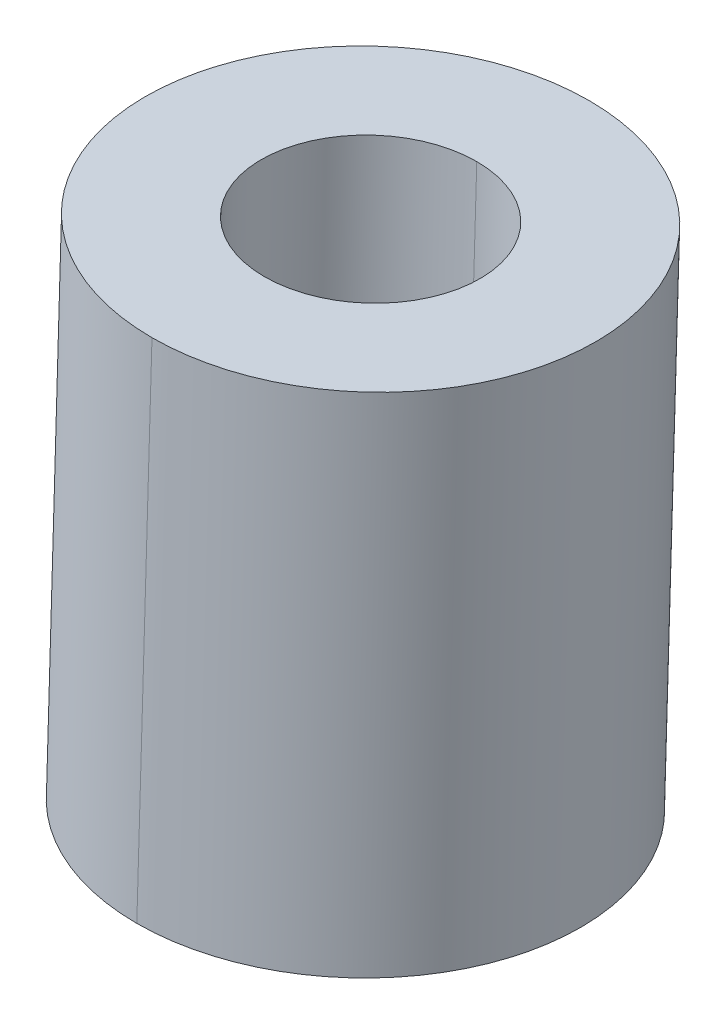
ISO-10303-21;
HEADER;
FILE_DESCRIPTION(('STEP AP214'),'2;1');
FILE_NAME('part.step','',(''),(''),'','','');
FILE_SCHEMA(('AUTOMOTIVE_DESIGN { 1 0 10303 214 1 1 1 1 }'));
ENDSEC;
DATA;
#1=APPLICATION_CONTEXT('core data for automotive mechanical design processes');
#2=APPLICATION_PROTOCOL_DEFINITION('international standard','automotive_design',2000,#1);
#3=PRODUCT_CONTEXT('',#1,'mechanical');
#4=PRODUCT('Part','Part','',(#3));
#5=PRODUCT_RELATED_PRODUCT_CATEGORY('part','',(#4));
#6=PRODUCT_DEFINITION_FORMATION('','',#4);
#7=PRODUCT_DEFINITION_CONTEXT('part definition',#1,'design');
#8=PRODUCT_DEFINITION('design','',#6,#7);
#9=PRODUCT_DEFINITION_SHAPE('','',#8);
#10=(LENGTH_UNIT() NAMED_UNIT(*) SI_UNIT(.MILLI.,.METRE.));
#11=(NAMED_UNIT(*) PLANE_ANGLE_UNIT() SI_UNIT($,.RADIAN.));
#12=(NAMED_UNIT(*) SI_UNIT($,.STERADIAN.) SOLID_ANGLE_UNIT());
#13=UNCERTAINTY_MEASURE_WITH_UNIT(LENGTH_MEASURE(1.E-05),#10,'distance_accuracy_value','');
#14=(GEOMETRIC_REPRESENTATION_CONTEXT(3) GLOBAL_UNCERTAINTY_ASSIGNED_CONTEXT((#13)) GLOBAL_UNIT_ASSIGNED_CONTEXT((#10,
#11,#12)) REPRESENTATION_CONTEXT('',''));
#15=CARTESIAN_POINT('',(0.,0.,0.));
#16=DIRECTION('',(0.,0.,1.));
#17=DIRECTION('',(1.,0.,0.));
#18=AXIS2_PLACEMENT_3D('',#15,#16,#17);
#19=CARTESIAN_POINT('',(30.8591364522028,255.883330990182,223.750519386136));
#20=DIRECTION('',(0.,-0.999538214785378,0.0303867929149983));
#21=DIRECTION('',(0.,-0.0303867929149983,-0.999538214785378));
#22=AXIS2_PLACEMENT_3D('',#19,#20,#21);
#23=CYLINDRICAL_SURFACE('',#22,1.7);
#24=DIRECTION('',(0.,-0.999538214785378,0.0303867929150144));
#25=VECTOR('',#24,1.);
#26=CARTESIAN_POINT('',(30.8591364522028,255.934988538137,225.449734351271));
#27=LINE('',#26,#25);
#28=CARTESIAN_POINT('',(30.8591364522028,255.934988538137,225.449734351271));
#29=VERTEX_POINT('',#28);
#30=CARTESIAN_POINT('',(30.8591364522028,247.938682819854,225.692828694591));
#31=VERTEX_POINT('',#30);
#32=EDGE_CURVE('E89',#29,#31,#27,.T.);
#33=ORIENTED_EDGE('',*,*,#32,.F.);
#34=CARTESIAN_POINT('',(30.8591364522028,255.883330990182,223.750519386136));
#35=DIRECTION('',(0.,0.999538214785378,-0.0303867929149983));
#36=DIRECTION('',(0.,0.0303867929149983,0.999538214785378));
#37=AXIS2_PLACEMENT_3D('',#34,#35,#36);
#38=CIRCLE('',#37,1.7);
#39=CARTESIAN_POINT('',(30.8591364522028,255.831673442226,222.051304421001));
#40=VERTEX_POINT('',#39);
#41=EDGE_CURVE('E19',#29,#40,#38,.T.);
#42=ORIENTED_EDGE('',*,*,#41,.T.);
#43=DIRECTION('',(0.,-0.999538214785378,0.0303867929150144));
#44=VECTOR('',#43,1.);
#45=CARTESIAN_POINT('',(30.8591364522028,255.831673442226,222.051304421001));
#46=LINE('',#45,#44);
#47=CARTESIAN_POINT('',(30.8591364522028,247.835367723943,222.294398764321));
#48=VERTEX_POINT('',#47);
#49=EDGE_CURVE('E81',#40,#48,#46,.T.);
#50=ORIENTED_EDGE('',*,*,#49,.T.);
#51=CARTESIAN_POINT('',(30.8591364522028,247.887025271899,223.993613729456));
#52=DIRECTION('',(0.,0.999538214785378,-0.0303867929150145));
#53=DIRECTION('',(0.,0.0303867929150145,0.999538214785378));
#54=AXIS2_PLACEMENT_3D('',#51,#52,#53);
#55=CIRCLE('',#54,1.7);
#56=EDGE_CURVE('E10',#31,#48,#55,.T.);
#57=ORIENTED_EDGE('',*,*,#56,.F.);
#58=EDGE_LOOP('',(#33,#42,#50,#57));
#59=FACE_BOUND('',#58,.T.);
#60=ADVANCED_FACE('F15',(#59),#23,.F.);
#61=CARTESIAN_POINT('',(30.8591364522028,255.883330990182,223.750519386136));
#62=DIRECTION('',(0.,-0.999538214785378,0.0303867929150206));
#63=DIRECTION('',(0.,-0.0303867929150207,-0.999538214785378));
#64=AXIS2_PLACEMENT_3D('',#61,#62,#63);
#65=CYLINDRICAL_SURFACE('',#64,3.5);
#66=DIRECTION('',(0.,-0.999538214785378,0.0303867929150144));
#67=VECTOR('',#66,1.);
#68=CARTESIAN_POINT('',(30.8591364522028,255.989684765384,227.248903137885));
#69=LINE('',#68,#67);
#70=CARTESIAN_POINT('',(30.8591364522028,255.989684765384,227.248903137885));
#71=VERTEX_POINT('',#70);
#72=CARTESIAN_POINT('',(30.8591364522028,247.993379047102,227.491997481204));
#73=VERTEX_POINT('',#72);
#74=EDGE_CURVE('E108',#71,#73,#69,.T.);
#75=ORIENTED_EDGE('',*,*,#74,.F.);
#76=CARTESIAN_POINT('',(30.8591364522028,255.883330990182,223.750519386136));
#77=DIRECTION('',(0.,0.999538214785378,-0.0303867929150206));
#78=DIRECTION('',(0.,0.0303867929150207,0.999538214785378));
#79=AXIS2_PLACEMENT_3D('',#76,#77,#78);
#80=CIRCLE('',#79,3.5);
#81=CARTESIAN_POINT('',(30.8591364522028,255.776977214979,220.252135634387));
#82=VERTEX_POINT('',#81);
#83=EDGE_CURVE('E66',#82,#71,#80,.T.);
#84=ORIENTED_EDGE('',*,*,#83,.F.);
#85=DIRECTION('',(0.,-0.999538214785378,0.0303867929150144));
#86=VECTOR('',#85,1.);
#87=CARTESIAN_POINT('',(30.8591364522028,255.776977214979,220.252135634387));
#88=LINE('',#87,#86);
#89=CARTESIAN_POINT('',(30.8591364522028,247.780671496696,220.495229977707));
#90=VERTEX_POINT('',#89);
#91=EDGE_CURVE('E102',#82,#90,#88,.T.);
#92=ORIENTED_EDGE('',*,*,#91,.T.);
#93=CARTESIAN_POINT('',(30.8591364522028,247.887025271899,223.993613729456));
#94=DIRECTION('',(0.,0.999538214785378,-0.0303867929150127));
#95=DIRECTION('',(0.,0.0303867929150127,0.999538214785378));
#96=AXIS2_PLACEMENT_3D('',#93,#94,#95);
#97=CIRCLE('',#96,3.5);
#98=EDGE_CURVE('E26',#90,#73,#97,.T.);
#99=ORIENTED_EDGE('',*,*,#98,.T.);
#100=EDGE_LOOP('',(#75,#84,#92,#99));
#101=FACE_BOUND('',#100,.T.);
#102=ADVANCED_FACE('F17',(#101),#65,.T.);
#103=CARTESIAN_POINT('',(30.8591364522028,247.887025271899,223.993613729456));
#104=DIRECTION('',(0.,0.999538214785378,-0.0303867929150144));
#105=DIRECTION('',(-1.,0.,0.));
#106=AXIS2_PLACEMENT_3D('',#103,#104,#105);
#107=PLANE('',#106);
#108=CARTESIAN_POINT('',(30.8591364522028,247.887025271899,223.993613729456));
#109=DIRECTION('',(0.,0.999538214785378,-0.0303867929150145));
#110=DIRECTION('',(0.,0.0303867929150145,0.999538214785378));
#111=AXIS2_PLACEMENT_3D('',#108,#109,#110);
#112=CIRCLE('',#111,1.7);
#113=EDGE_CURVE('E76',#48,#31,#112,.T.);
#114=ORIENTED_EDGE('',*,*,#113,.T.);
#115=ORIENTED_EDGE('',*,*,#56,.T.);
#116=EDGE_LOOP('',(#114,#115));
#117=FACE_BOUND('',#116,.T.);
#118=ORIENTED_EDGE('',*,*,#98,.F.);
#119=CARTESIAN_POINT('',(30.8591364522028,247.887025271899,223.993613729456));
#120=DIRECTION('',(0.,0.999538214785378,-0.0303867929150127));
#121=DIRECTION('',(0.,0.0303867929150127,0.999538214785378));
#122=AXIS2_PLACEMENT_3D('',#119,#120,#121);
#123=CIRCLE('',#122,3.5);
#124=EDGE_CURVE('E104',#73,#90,#123,.T.);
#125=ORIENTED_EDGE('',*,*,#124,.F.);
#126=EDGE_LOOP('',(#118,#125));
#127=FACE_BOUND('',#126,.T.);
#128=ADVANCED_FACE('F74',(#117,#127),#107,.F.);
#129=CARTESIAN_POINT('',(30.8591364522028,255.883330990182,223.750519386136));
#130=DIRECTION('',(0.,0.999538214785378,-0.0303867929150144));
#131=DIRECTION('',(-1.,0.,0.));
#132=AXIS2_PLACEMENT_3D('',#129,#130,#131);
#133=PLANE('',#132);
#134=CARTESIAN_POINT('',(30.8591364522028,255.883330990182,223.750519386136));
#135=DIRECTION('',(0.,0.999538214785378,-0.0303867929149983));
#136=DIRECTION('',(0.,0.0303867929149983,0.999538214785378));
#137=AXIS2_PLACEMENT_3D('',#134,#135,#136);
#138=CIRCLE('',#137,1.7);
#139=EDGE_CURVE('E96',#40,#29,#138,.T.);
#140=ORIENTED_EDGE('',*,*,#139,.F.);
#141=ORIENTED_EDGE('',*,*,#41,.F.);
#142=EDGE_LOOP('',(#140,#141));
#143=FACE_BOUND('',#142,.T.);
#144=ORIENTED_EDGE('',*,*,#83,.T.);
#145=CARTESIAN_POINT('',(30.8591364522028,255.883330990182,223.750519386136));
#146=DIRECTION('',(0.,0.999538214785378,-0.0303867929150206));
#147=DIRECTION('',(0.,0.0303867929150207,0.999538214785378));
#148=AXIS2_PLACEMENT_3D('',#145,#146,#147);
#149=CIRCLE('',#148,3.5);
#150=EDGE_CURVE('E86',#71,#82,#149,.T.);
#151=ORIENTED_EDGE('',*,*,#150,.T.);
#152=EDGE_LOOP('',(#144,#151));
#153=FACE_BOUND('',#152,.T.);
#154=ADVANCED_FACE('F138',(#143,#153),#133,.T.);
#155=CARTESIAN_POINT('',(30.8591364522028,255.883330990182,223.750519386136));
#156=DIRECTION('',(0.,-0.999538214785378,0.0303867929150206));
#157=DIRECTION('',(0.,-0.0303867929150207,-0.999538214785378));
#158=AXIS2_PLACEMENT_3D('',#155,#156,#157);
#159=CYLINDRICAL_SURFACE('',#158,3.5);
#160=ORIENTED_EDGE('',*,*,#150,.F.);
#161=ORIENTED_EDGE('',*,*,#74,.T.);
#162=ORIENTED_EDGE('',*,*,#124,.T.);
#163=ORIENTED_EDGE('',*,*,#91,.F.);
#164=EDGE_LOOP('',(#160,#161,#162,#163));
#165=FACE_BOUND('',#164,.T.);
#166=ADVANCED_FACE('F143',(#165),#159,.T.);
#167=CARTESIAN_POINT('',(30.8591364522028,255.883330990182,223.750519386136));
#168=DIRECTION('',(0.,-0.999538214785378,0.0303867929149983));
#169=DIRECTION('',(0.,-0.0303867929149983,-0.999538214785378));
#170=AXIS2_PLACEMENT_3D('',#167,#168,#169);
#171=CYLINDRICAL_SURFACE('',#170,1.7);
#172=ORIENTED_EDGE('',*,*,#139,.T.);
#173=ORIENTED_EDGE('',*,*,#32,.T.);
#174=ORIENTED_EDGE('',*,*,#113,.F.);
#175=ORIENTED_EDGE('',*,*,#49,.F.);
#176=EDGE_LOOP('',(#172,#173,#174,#175));
#177=FACE_BOUND('',#176,.T.);
#178=ADVANCED_FACE('F88',(#177),#171,.F.);
#179=CLOSED_SHELL('',(#60,#102,#128,#154,#166,#178));
#180=MANIFOLD_SOLID_BREP('B1',#179);
#181=ADVANCED_BREP_SHAPE_REPRESENTATION('',(#18,#180),#14);
#182=SHAPE_DEFINITION_REPRESENTATION(#9,#181);
ENDSEC;
END-ISO-10303-21;
